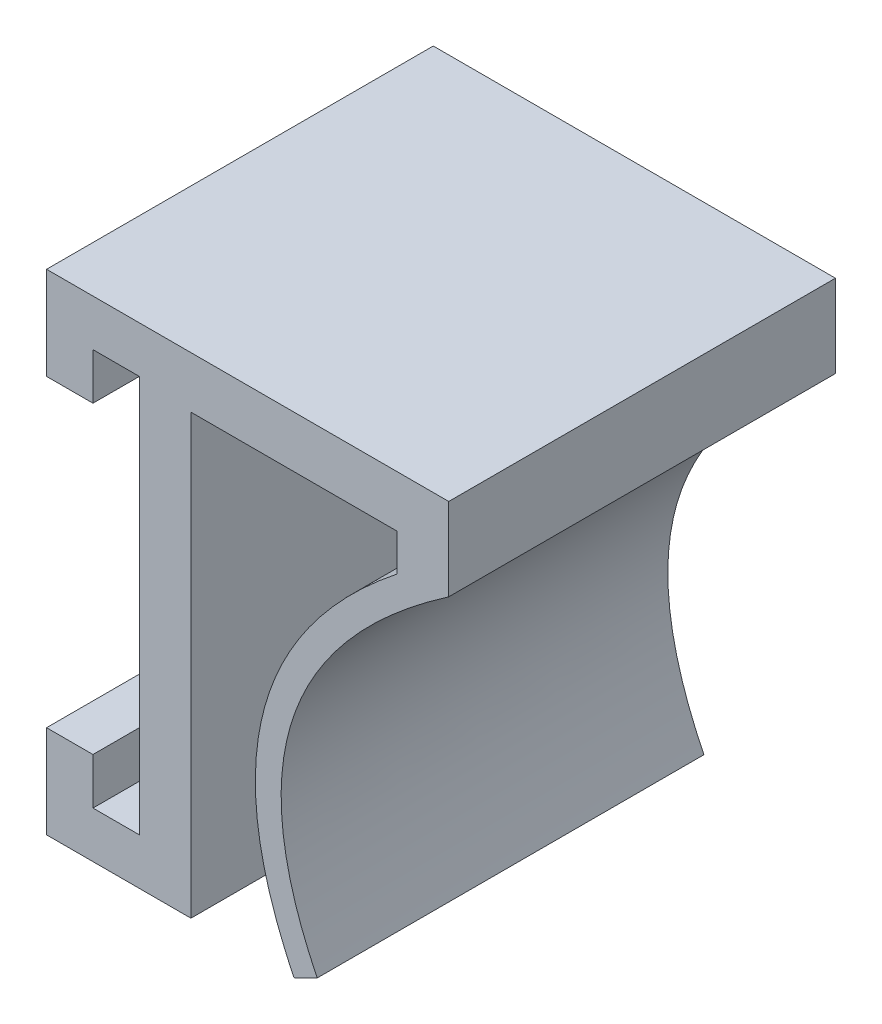
ISO-10303-21;
HEADER;
FILE_DESCRIPTION(('STEP AP214'),'2;1');
FILE_NAME('part.step','',(''),(''),'','','');
FILE_SCHEMA(('AUTOMOTIVE_DESIGN { 1 0 10303 214 1 1 1 1 }'));
ENDSEC;
DATA;
#1=APPLICATION_CONTEXT('core data for automotive mechanical design processes');
#2=APPLICATION_PROTOCOL_DEFINITION('international standard','automotive_design',2000,#1);
#3=PRODUCT_CONTEXT('',#1,'mechanical');
#4=PRODUCT('Part','Part','',(#3));
#5=PRODUCT_RELATED_PRODUCT_CATEGORY('part','',(#4));
#6=PRODUCT_DEFINITION_FORMATION('','',#4);
#7=PRODUCT_DEFINITION_CONTEXT('part definition',#1,'design');
#8=PRODUCT_DEFINITION('design','',#6,#7);
#9=PRODUCT_DEFINITION_SHAPE('','',#8);
#10=(LENGTH_UNIT() NAMED_UNIT(*) SI_UNIT(.MILLI.,.METRE.));
#11=(NAMED_UNIT(*) PLANE_ANGLE_UNIT() SI_UNIT($,.RADIAN.));
#12=(NAMED_UNIT(*) SI_UNIT($,.STERADIAN.) SOLID_ANGLE_UNIT());
#13=UNCERTAINTY_MEASURE_WITH_UNIT(LENGTH_MEASURE(1.E-05),#10,'distance_accuracy_value','');
#14=(GEOMETRIC_REPRESENTATION_CONTEXT(3) GLOBAL_UNCERTAINTY_ASSIGNED_CONTEXT((#13)) GLOBAL_UNIT_ASSIGNED_CONTEXT((#10,
#11,#12)) REPRESENTATION_CONTEXT('',''));
#15=CARTESIAN_POINT('',(0.,0.,0.));
#16=DIRECTION('',(0.,0.,1.));
#17=DIRECTION('',(1.,0.,0.));
#18=AXIS2_PLACEMENT_3D('',#15,#16,#17);
#19=CARTESIAN_POINT('',(-4.6,7.7,0.));
#20=DIRECTION('',(0.,1.,0.));
#21=DIRECTION('',(0.,0.,1.));
#22=AXIS2_PLACEMENT_3D('',#19,#20,#21);
#23=PLANE('',#22);
#24=DIRECTION('',(0.,0.,1.));
#25=VECTOR('',#24,1.);
#26=CARTESIAN_POINT('',(-2.8,7.7,0.));
#27=LINE('',#26,#25);
#28=CARTESIAN_POINT('',(-2.8,7.7,0.));
#29=VERTEX_POINT('',#28);
#30=CARTESIAN_POINT('',(-2.8,7.7,15.));
#31=VERTEX_POINT('',#30);
#32=EDGE_CURVE('E193',#29,#31,#27,.T.);
#33=ORIENTED_EDGE('',*,*,#32,.F.);
#34=DIRECTION('',(1.,0.,0.));
#35=VECTOR('',#34,1.);
#36=CARTESIAN_POINT('',(-4.6,7.7,0.));
#37=LINE('',#36,#35);
#38=CARTESIAN_POINT('',(-1.,7.7,0.));
#39=VERTEX_POINT('',#38);
#40=EDGE_CURVE('E41',#29,#39,#37,.T.);
#41=ORIENTED_EDGE('',*,*,#40,.T.);
#42=DIRECTION('',(0.,0.,1.));
#43=VECTOR('',#42,1.);
#44=CARTESIAN_POINT('',(-1.,7.7,0.));
#45=LINE('',#44,#43);
#46=CARTESIAN_POINT('',(-1.,7.7,15.));
#47=VERTEX_POINT('',#46);
#48=EDGE_CURVE('E178',#39,#47,#45,.T.);
#49=ORIENTED_EDGE('',*,*,#48,.T.);
#50=DIRECTION('',(1.,0.,0.));
#51=VECTOR('',#50,1.);
#52=CARTESIAN_POINT('',(-4.6,7.7,15.));
#53=LINE('',#52,#51);
#54=EDGE_CURVE('E234',#31,#47,#53,.T.);
#55=ORIENTED_EDGE('',*,*,#54,.F.);
#56=EDGE_LOOP('',(#33,#41,#49,#55));
#57=FACE_BOUND('',#56,.T.);
#58=ADVANCED_FACE('F37',(#57),#23,.F.);
#59=CARTESIAN_POINT('',(-4.6,-7.7,15.));
#60=DIRECTION('',(0.,-1.,0.));
#61=DIRECTION('',(0.,0.,-1.));
#62=AXIS2_PLACEMENT_3D('',#59,#60,#61);
#63=PLANE('',#62);
#64=DIRECTION('',(0.,0.,-1.));
#65=VECTOR('',#64,1.);
#66=CARTESIAN_POINT('',(-2.8,-7.7,15.));
#67=LINE('',#66,#65);
#68=CARTESIAN_POINT('',(-2.8,-7.7,15.));
#69=VERTEX_POINT('',#68);
#70=CARTESIAN_POINT('',(-2.8,-7.7,0.));
#71=VERTEX_POINT('',#70);
#72=EDGE_CURVE('E203',#69,#71,#67,.T.);
#73=ORIENTED_EDGE('',*,*,#72,.F.);
#74=DIRECTION('',(1.,0.,0.));
#75=VECTOR('',#74,1.);
#76=CARTESIAN_POINT('',(-4.6,-7.7,15.));
#77=LINE('',#76,#75);
#78=CARTESIAN_POINT('',(-1.,-7.7,15.));
#79=VERTEX_POINT('',#78);
#80=EDGE_CURVE('E230',#69,#79,#77,.T.);
#81=ORIENTED_EDGE('',*,*,#80,.T.);
#82=DIRECTION('',(0.,0.,-1.));
#83=VECTOR('',#82,1.);
#84=CARTESIAN_POINT('',(-1.,-7.7,15.));
#85=LINE('',#84,#83);
#86=CARTESIAN_POINT('',(-1.,-7.7,0.));
#87=VERTEX_POINT('',#86);
#88=EDGE_CURVE('E219',#79,#87,#85,.T.);
#89=ORIENTED_EDGE('',*,*,#88,.T.);
#90=DIRECTION('',(1.,0.,0.));
#91=VECTOR('',#90,1.);
#92=CARTESIAN_POINT('',(-4.6,-7.7,0.));
#93=LINE('',#92,#91);
#94=EDGE_CURVE('E55',#71,#87,#93,.T.);
#95=ORIENTED_EDGE('',*,*,#94,.F.);
#96=EDGE_LOOP('',(#73,#81,#89,#95));
#97=FACE_BOUND('',#96,.T.);
#98=ADVANCED_FACE('F359',(#97),#63,.F.);
#99=CARTESIAN_POINT('',(-1.,0.,15.));
#100=DIRECTION('',(-1.,0.,0.));
#101=DIRECTION('',(0.,0.,1.));
#102=AXIS2_PLACEMENT_3D('',#99,#100,#101);
#103=PLANE('',#102);
#104=DIRECTION('',(0.,1.,0.));
#105=VECTOR('',#104,1.);
#106=CARTESIAN_POINT('',(-1.,0.,0.));
#107=LINE('',#106,#105);
#108=EDGE_CURVE('E251',#87,#39,#107,.T.);
#109=ORIENTED_EDGE('',*,*,#108,.F.);
#110=ORIENTED_EDGE('',*,*,#88,.F.);
#111=DIRECTION('',(0.,1.,0.));
#112=VECTOR('',#111,1.);
#113=CARTESIAN_POINT('',(-1.,0.,15.));
#114=LINE('',#113,#112);
#115=EDGE_CURVE('E246',#79,#47,#114,.T.);
#116=ORIENTED_EDGE('',*,*,#115,.T.);
#117=ORIENTED_EDGE('',*,*,#48,.F.);
#118=EDGE_LOOP('',(#109,#110,#116,#117));
#119=FACE_BOUND('',#118,.T.);
#120=ADVANCED_FACE('F356',(#119),#103,.T.);
#121=CARTESIAN_POINT('',(9.00000000000001,0.,15.));
#122=DIRECTION('',(1.,0.,0.));
#123=DIRECTION('',(0.,1.,0.));
#124=AXIS2_PLACEMENT_3D('',#121,#122,#123);
#125=PLANE('',#124);
#126=DIRECTION('',(0.,-1.,0.));
#127=VECTOR('',#126,1.);
#128=CARTESIAN_POINT('',(9.00000000000001,0.,0.));
#129=LINE('',#128,#127);
#130=CARTESIAN_POINT('',(9.,7.5,0.));
#131=VERTEX_POINT('',#130);
#132=CARTESIAN_POINT('',(9.00000000000002,6.06380107189524,0.));
#133=VERTEX_POINT('',#132);
#134=EDGE_CURVE('E263',#131,#133,#129,.T.);
#135=ORIENTED_EDGE('',*,*,#134,.T.);
#136=DIRECTION('',(0.,0.,-1.));
#137=VECTOR('',#136,1.);
#138=CARTESIAN_POINT('',(9.00000000000002,6.06380107189524,15.));
#139=LINE('',#138,#137);
#140=CARTESIAN_POINT('',(9.00000000000002,6.06380107189524,15.));
#141=VERTEX_POINT('',#140);
#142=EDGE_CURVE('E11',#141,#133,#139,.T.);
#143=ORIENTED_EDGE('',*,*,#142,.F.);
#144=DIRECTION('',(0.,-1.,0.));
#145=VECTOR('',#144,1.);
#146=CARTESIAN_POINT('',(9.00000000000001,0.,15.));
#147=LINE('',#146,#145);
#148=CARTESIAN_POINT('',(9.,7.5,15.));
#149=VERTEX_POINT('',#148);
#150=EDGE_CURVE('E237',#149,#141,#147,.T.);
#151=ORIENTED_EDGE('',*,*,#150,.F.);
#152=DIRECTION('',(0.,0.,-1.));
#153=VECTOR('',#152,1.);
#154=CARTESIAN_POINT('',(9.,7.5,15.));
#155=LINE('',#154,#153);
#156=EDGE_CURVE('E262',#149,#131,#155,.T.);
#157=ORIENTED_EDGE('',*,*,#156,.T.);
#158=EDGE_LOOP('',(#135,#143,#151,#157));
#159=FACE_BOUND('',#158,.T.);
#160=ADVANCED_FACE('F39',(#159),#125,.F.);
#161=CARTESIAN_POINT('',(11.,7.5,15.));
#162=CARTESIAN_POINT('',(0.143474786083557,0.403042209398093,15.));
#163=CARTESIAN_POINT('',(5.,-9.5,15.));
#164=B_SPLINE_CURVE_WITH_KNOTS('',2,(#161,#162,#163),.UNSPECIFIED.,.F.,.F.,(3,3),(0.,1.),.UNSPECIFIED.);
#165=DIRECTION('',(0.,0.,-1.));
#166=VECTOR('',#165,1.);
#167=SURFACE_OF_LINEAR_EXTRUSION('',#164,#166);
#168=CARTESIAN_POINT('',(11.,7.5,0.));
#169=CARTESIAN_POINT('',(0.143474786083557,0.403042209398093,0.));
#170=CARTESIAN_POINT('',(5.,-9.5,0.));
#171=B_SPLINE_CURVE_WITH_KNOTS('',2,(#168,#169,#170),.UNSPECIFIED.,.F.,.F.,(3,3),(0.,1.),.UNSPECIFIED.);
#172=CARTESIAN_POINT('',(5.,-9.5,0.));
#173=VERTEX_POINT('',#172);
#174=EDGE_CURVE('E266',#133,#173,#171,.T.);
#175=ORIENTED_EDGE('',*,*,#174,.T.);
#176=DIRECTION('',(0.,0.,-1.));
#177=VECTOR('',#176,1.);
#178=CARTESIAN_POINT('',(5.,-9.5,15.));
#179=LINE('',#178,#177);
#180=CARTESIAN_POINT('',(5.,-9.5,15.));
#181=VERTEX_POINT('',#180);
#182=EDGE_CURVE('E47',#181,#173,#179,.T.);
#183=ORIENTED_EDGE('',*,*,#182,.F.);
#184=EDGE_CURVE('E332',#141,#181,#164,.T.);
#185=ORIENTED_EDGE('',*,*,#184,.F.);
#186=ORIENTED_EDGE('',*,*,#142,.T.);
#187=EDGE_LOOP('',(#175,#183,#185,#186));
#188=FACE_BOUND('',#187,.T.);
#189=ADVANCED_FACE('F318',(#188),#167,.F.);
#190=CARTESIAN_POINT('',(4.72500618414528,-9.63485900313563,15.));
#191=DIRECTION('',(0.440310188345007,-0.897845720622192,0.));
#192=DIRECTION('',(0.897845720622193,0.440310188345007,0.));
#193=AXIS2_PLACEMENT_3D('',#190,#191,#192);
#194=PLANE('',#193);
#195=DIRECTION('',(-0.897845720622193,-0.440310188345007,0.));
#196=VECTOR('',#195,1.);
#197=CARTESIAN_POINT('',(4.72500618414528,-9.63485900313563,0.));
#198=LINE('',#197,#196);
#199=CARTESIAN_POINT('',(5.89784572062219,-9.05968981165499,0.));
#200=VERTEX_POINT('',#199);
#201=EDGE_CURVE('E271',#200,#173,#198,.T.);
#202=ORIENTED_EDGE('',*,*,#201,.F.);
#203=DIRECTION('',(0.,0.,-1.));
#204=VECTOR('',#203,1.);
#205=CARTESIAN_POINT('',(5.89784572062219,-9.05968981165499,15.));
#206=LINE('',#205,#204);
#207=CARTESIAN_POINT('',(5.89784572062219,-9.05968981165499,15.));
#208=VERTEX_POINT('',#207);
#209=EDGE_CURVE('E309',#208,#200,#206,.T.);
#210=ORIENTED_EDGE('',*,*,#209,.F.);
#211=DIRECTION('',(-0.897845720622193,-0.440310188345007,0.));
#212=VECTOR('',#211,1.);
#213=CARTESIAN_POINT('',(4.72500618414528,-9.63485900313563,15.));
#214=LINE('',#213,#212);
#215=EDGE_CURVE('E316',#208,#181,#214,.T.);
#216=ORIENTED_EDGE('',*,*,#215,.T.);
#217=ORIENTED_EDGE('',*,*,#182,.T.);
#218=EDGE_LOOP('',(#202,#210,#216,#217));
#219=FACE_BOUND('',#218,.T.);
#220=ADVANCED_FACE('F314',(#219),#194,.T.);
#221=CARTESIAN_POINT('',(11.5470604344014,6.66313817495737,15.));
#222=CARTESIAN_POINT('',(11.1227751702756,6.38577545488294,15.));
#223=CARTESIAN_POINT('',(10.2701754162105,5.79545603749895,15.));
#224=CARTESIAN_POINT('',(8.78130683710781,4.62611565499444,15.));
#225=CARTESIAN_POINT('',(7.21781689140354,3.11882700941996,15.));
#226=CARTESIAN_POINT('',(5.84244774640844,1.26956398370126,15.));
#227=CARTESIAN_POINT('',(4.93949451068362,-0.62198273362906,15.));
#228=CARTESIAN_POINT('',(4.48743622100348,-2.56912245970935,15.));
#229=CARTESIAN_POINT('',(4.47319251706102,-4.6027365782481,15.));
#230=CARTESIAN_POINT('',(4.83887317710128,-6.40107531519846,15.));
#231=CARTESIAN_POINT('',(5.36072254535897,-7.89234167440535,15.));
#232=CARTESIAN_POINT('',(5.71204382820357,-8.68082613964558,15.));
#233=CARTESIAN_POINT('',(5.89784572062217,-9.05968981165496,15.));
#234=B_SPLINE_CURVE_WITH_KNOTS('',3,(#221,#222,#223,#224,#225,#226,#227,#228,#229,#230,#231,
#232,#233),.UNSPECIFIED.,.F.,.F.,(4,1,1,1,1,1,1,1,1,1,4),(0.,0.0625,0.125,0.25,0.375,0.5,0.625,
0.75,0.875,0.9375,1.),.UNSPECIFIED.);
#235=DIRECTION('',(0.,0.,-1.));
#236=VECTOR('',#235,1.);
#237=SURFACE_OF_LINEAR_EXTRUSION('',#234,#236);
#238=CARTESIAN_POINT('',(11.5470604344014,6.66313817495737,0.));
#239=CARTESIAN_POINT('',(11.1227751702756,6.38577545488294,0.));
#240=CARTESIAN_POINT('',(10.2701754162105,5.79545603749895,0.));
#241=CARTESIAN_POINT('',(8.78130683710781,4.62611565499444,0.));
#242=CARTESIAN_POINT('',(7.21781689140354,3.11882700941996,0.));
#243=CARTESIAN_POINT('',(5.84244774640844,1.26956398370126,0.));
#244=CARTESIAN_POINT('',(4.93949451068362,-0.62198273362906,0.));
#245=CARTESIAN_POINT('',(4.48743622100348,-2.56912245970935,0.));
#246=CARTESIAN_POINT('',(4.47319251706102,-4.6027365782481,0.));
#247=CARTESIAN_POINT('',(4.83887317710128,-6.40107531519846,0.));
#248=CARTESIAN_POINT('',(5.36072254535897,-7.89234167440535,0.));
#249=CARTESIAN_POINT('',(5.71204382820357,-8.68082613964558,0.));
#250=CARTESIAN_POINT('',(5.89784572062217,-9.05968981165496,0.));
#251=B_SPLINE_CURVE_WITH_KNOTS('',3,(#238,#239,#240,#241,#242,#243,#244,#245,#246,#247,#248,
#249,#250),.UNSPECIFIED.,.F.,.F.,(4,1,1,1,1,1,1,1,1,1,4),(0.,0.0625,0.125,0.25,0.375,0.5,0.625,
0.75,0.875,0.9375,1.),.UNSPECIFIED.);
#252=CARTESIAN_POINT('',(11.,6.29635969257211,0.));
#253=VERTEX_POINT('',#252);
#254=EDGE_CURVE('E277',#253,#200,#251,.T.);
#255=ORIENTED_EDGE('',*,*,#254,.F.);
#256=DIRECTION('',(0.,0.,-1.));
#257=VECTOR('',#256,1.);
#258=CARTESIAN_POINT('',(11.,6.29635969257211,15.));
#259=LINE('',#258,#257);
#260=CARTESIAN_POINT('',(11.,6.29635969257211,15.));
#261=VERTEX_POINT('',#260);
#262=EDGE_CURVE('E307',#261,#253,#259,.T.);
#263=ORIENTED_EDGE('',*,*,#262,.F.);
#264=EDGE_CURVE('E326',#261,#208,#234,.T.);
#265=ORIENTED_EDGE('',*,*,#264,.T.);
#266=ORIENTED_EDGE('',*,*,#209,.T.);
#267=EDGE_LOOP('',(#255,#263,#265,#266));
#268=FACE_BOUND('',#267,.T.);
#269=ADVANCED_FACE('F323',(#268),#237,.T.);
#270=CARTESIAN_POINT('',(11.,0.,15.));
#271=DIRECTION('',(1.,0.,0.));
#272=DIRECTION('',(0.,1.,0.));
#273=AXIS2_PLACEMENT_3D('',#270,#271,#272);
#274=PLANE('',#273);
#275=DIRECTION('',(0.,-1.,0.));
#276=VECTOR('',#275,1.);
#277=CARTESIAN_POINT('',(11.,0.,0.));
#278=LINE('',#277,#276);
#279=CARTESIAN_POINT('',(11.,9.5,0.));
#280=VERTEX_POINT('',#279);
#281=EDGE_CURVE('E282',#280,#253,#278,.T.);
#282=ORIENTED_EDGE('',*,*,#281,.F.);
#283=DIRECTION('',(0.,0.,-1.));
#284=VECTOR('',#283,1.);
#285=CARTESIAN_POINT('',(11.,9.5,15.));
#286=LINE('',#285,#284);
#287=CARTESIAN_POINT('',(11.,9.5,15.));
#288=VERTEX_POINT('',#287);
#289=EDGE_CURVE('E305',#288,#280,#286,.T.);
#290=ORIENTED_EDGE('',*,*,#289,.F.);
#291=DIRECTION('',(0.,-1.,0.));
#292=VECTOR('',#291,1.);
#293=CARTESIAN_POINT('',(11.,0.,15.));
#294=LINE('',#293,#292);
#295=EDGE_CURVE('E334',#288,#261,#294,.T.);
#296=ORIENTED_EDGE('',*,*,#295,.T.);
#297=ORIENTED_EDGE('',*,*,#262,.T.);
#298=EDGE_LOOP('',(#282,#290,#296,#297));
#299=FACE_BOUND('',#298,.T.);
#300=ADVANCED_FACE('F349',(#299),#274,.T.);
#301=CARTESIAN_POINT('',(0.,9.5,15.));
#302=DIRECTION('',(0.,1.,0.));
#303=DIRECTION('',(0.,0.,1.));
#304=AXIS2_PLACEMENT_3D('',#301,#302,#303);
#305=PLANE('',#304);
#306=DIRECTION('',(1.,0.,0.));
#307=VECTOR('',#306,1.);
#308=CARTESIAN_POINT('',(0.,9.5,0.));
#309=LINE('',#308,#307);
#310=CARTESIAN_POINT('',(-4.6,9.5,0.));
#311=VERTEX_POINT('',#310);
#312=EDGE_CURVE('E288',#311,#280,#309,.T.);
#313=ORIENTED_EDGE('',*,*,#312,.F.);
#314=DIRECTION('',(0.,0.,-1.));
#315=VECTOR('',#314,1.);
#316=CARTESIAN_POINT('',(-4.6,9.5,0.));
#317=LINE('',#316,#315);
#318=CARTESIAN_POINT('',(-4.6,9.5,15.));
#319=VERTEX_POINT('',#318);
#320=EDGE_CURVE('E175',#319,#311,#317,.T.);
#321=ORIENTED_EDGE('',*,*,#320,.F.);
#322=DIRECTION('',(1.,0.,0.));
#323=VECTOR('',#322,1.);
#324=CARTESIAN_POINT('',(0.,9.5,15.));
#325=LINE('',#324,#323);
#326=EDGE_CURVE('E250',#319,#288,#325,.T.);
#327=ORIENTED_EDGE('',*,*,#326,.T.);
#328=ORIENTED_EDGE('',*,*,#289,.T.);
#329=EDGE_LOOP('',(#313,#321,#327,#328));
#330=FACE_BOUND('',#329,.T.);
#331=ADVANCED_FACE('F383',(#330),#305,.T.);
#332=CARTESIAN_POINT('',(0.,-9.5,15.));
#333=DIRECTION('',(0.,1.,0.));
#334=DIRECTION('',(0.,0.,1.));
#335=AXIS2_PLACEMENT_3D('',#332,#333,#334);
#336=PLANE('',#335);
#337=DIRECTION('',(1.,0.,0.));
#338=VECTOR('',#337,1.);
#339=CARTESIAN_POINT('',(0.,-9.5,0.));
#340=LINE('',#339,#338);
#341=CARTESIAN_POINT('',(-4.6,-9.5,0.));
#342=VERTEX_POINT('',#341);
#343=CARTESIAN_POINT('',(1.,-9.5,0.));
#344=VERTEX_POINT('',#343);
#345=EDGE_CURVE('E291',#342,#344,#340,.T.);
#346=ORIENTED_EDGE('',*,*,#345,.T.);
#347=DIRECTION('',(0.,0.,-1.));
#348=VECTOR('',#347,1.);
#349=CARTESIAN_POINT('',(1.,-9.5,15.));
#350=LINE('',#349,#348);
#351=CARTESIAN_POINT('',(1.,-9.5,15.));
#352=VERTEX_POINT('',#351);
#353=EDGE_CURVE('E302',#352,#344,#350,.T.);
#354=ORIENTED_EDGE('',*,*,#353,.F.);
#355=DIRECTION('',(1.,0.,0.));
#356=VECTOR('',#355,1.);
#357=CARTESIAN_POINT('',(0.,-9.5,15.));
#358=LINE('',#357,#356);
#359=CARTESIAN_POINT('',(-4.6,-9.5,15.));
#360=VERTEX_POINT('',#359);
#361=EDGE_CURVE('E249',#360,#352,#358,.T.);
#362=ORIENTED_EDGE('',*,*,#361,.F.);
#363=DIRECTION('',(0.,0.,1.));
#364=VECTOR('',#363,1.);
#365=CARTESIAN_POINT('',(-4.6,-9.5,15.));
#366=LINE('',#365,#364);
#367=EDGE_CURVE('E225',#342,#360,#366,.T.);
#368=ORIENTED_EDGE('',*,*,#367,.F.);
#369=EDGE_LOOP('',(#346,#354,#362,#368));
#370=FACE_BOUND('',#369,.T.);
#371=ADVANCED_FACE('F379',(#370),#336,.F.);
#372=CARTESIAN_POINT('',(1.,0.,15.));
#373=DIRECTION('',(-1.,0.,0.));
#374=DIRECTION('',(0.,-1.,0.));
#375=AXIS2_PLACEMENT_3D('',#372,#373,#374);
#376=PLANE('',#375);
#377=DIRECTION('',(0.,1.,0.));
#378=VECTOR('',#377,1.);
#379=CARTESIAN_POINT('',(1.,0.,0.));
#380=LINE('',#379,#378);
#381=CARTESIAN_POINT('',(1.,7.5,0.));
#382=VERTEX_POINT('',#381);
#383=EDGE_CURVE('E293',#344,#382,#380,.T.);
#384=ORIENTED_EDGE('',*,*,#383,.T.);
#385=DIRECTION('',(0.,0.,-1.));
#386=VECTOR('',#385,1.);
#387=CARTESIAN_POINT('',(1.,7.5,15.));
#388=LINE('',#387,#386);
#389=CARTESIAN_POINT('',(1.,7.5,15.));
#390=VERTEX_POINT('',#389);
#391=EDGE_CURVE('E299',#390,#382,#388,.T.);
#392=ORIENTED_EDGE('',*,*,#391,.F.);
#393=DIRECTION('',(0.,1.,0.));
#394=VECTOR('',#393,1.);
#395=CARTESIAN_POINT('',(1.,0.,15.));
#396=LINE('',#395,#394);
#397=EDGE_CURVE('E258',#352,#390,#396,.T.);
#398=ORIENTED_EDGE('',*,*,#397,.F.);
#399=ORIENTED_EDGE('',*,*,#353,.T.);
#400=EDGE_LOOP('',(#384,#392,#398,#399));
#401=FACE_BOUND('',#400,.T.);
#402=ADVANCED_FACE('F375',(#401),#376,.F.);
#403=CARTESIAN_POINT('',(0.,7.5,15.));
#404=DIRECTION('',(0.,1.,0.));
#405=DIRECTION('',(0.,0.,1.));
#406=AXIS2_PLACEMENT_3D('',#403,#404,#405);
#407=PLANE('',#406);
#408=DIRECTION('',(1.,0.,0.));
#409=VECTOR('',#408,1.);
#410=CARTESIAN_POINT('',(0.,7.5,0.));
#411=LINE('',#410,#409);
#412=EDGE_CURVE('E295',#382,#131,#411,.T.);
#413=ORIENTED_EDGE('',*,*,#412,.T.);
#414=ORIENTED_EDGE('',*,*,#156,.F.);
#415=DIRECTION('',(1.,0.,0.));
#416=VECTOR('',#415,1.);
#417=CARTESIAN_POINT('',(0.,7.5,15.));
#418=LINE('',#417,#416);
#419=EDGE_CURVE('E260',#390,#149,#418,.T.);
#420=ORIENTED_EDGE('',*,*,#419,.F.);
#421=ORIENTED_EDGE('',*,*,#391,.T.);
#422=EDGE_LOOP('',(#413,#414,#420,#421));
#423=FACE_BOUND('',#422,.T.);
#424=ADVANCED_FACE('F370',(#423),#407,.F.);
#425=CARTESIAN_POINT('',(0.,0.,15.));
#426=DIRECTION('',(0.,0.,1.));
#427=DIRECTION('',(1.,0.,0.));
#428=AXIS2_PLACEMENT_3D('',#425,#426,#427);
#429=PLANE('',#428);
#430=ORIENTED_EDGE('',*,*,#150,.T.);
#431=ORIENTED_EDGE('',*,*,#184,.T.);
#432=ORIENTED_EDGE('',*,*,#215,.F.);
#433=ORIENTED_EDGE('',*,*,#264,.F.);
#434=ORIENTED_EDGE('',*,*,#295,.F.);
#435=ORIENTED_EDGE('',*,*,#326,.F.);
#436=DIRECTION('',(0.,1.,0.));
#437=VECTOR('',#436,1.);
#438=CARTESIAN_POINT('',(-4.6,9.5,15.));
#439=LINE('',#438,#437);
#440=CARTESIAN_POINT('',(-4.6,5.9,15.));
#441=VERTEX_POINT('',#440);
#442=EDGE_CURVE('E177',#441,#319,#439,.T.);
#443=ORIENTED_EDGE('',*,*,#442,.F.);
#444=DIRECTION('',(-1.,0.,0.));
#445=VECTOR('',#444,1.);
#446=CARTESIAN_POINT('',(-4.6,5.9,15.));
#447=LINE('',#446,#445);
#448=CARTESIAN_POINT('',(-2.8,5.9,15.));
#449=VERTEX_POINT('',#448);
#450=EDGE_CURVE('E192',#449,#441,#447,.T.);
#451=ORIENTED_EDGE('',*,*,#450,.F.);
#452=DIRECTION('',(0.,1.,0.));
#453=VECTOR('',#452,1.);
#454=CARTESIAN_POINT('',(-2.8,5.9,15.));
#455=LINE('',#454,#453);
#456=EDGE_CURVE('E198',#449,#31,#455,.T.);
#457=ORIENTED_EDGE('',*,*,#456,.T.);
#458=ORIENTED_EDGE('',*,*,#54,.T.);
#459=ORIENTED_EDGE('',*,*,#115,.F.);
#460=ORIENTED_EDGE('',*,*,#80,.F.);
#461=DIRECTION('',(0.,-1.,0.));
#462=VECTOR('',#461,1.);
#463=CARTESIAN_POINT('',(-2.8,-5.9,15.));
#464=LINE('',#463,#462);
#465=CARTESIAN_POINT('',(-2.8,-5.9,15.));
#466=VERTEX_POINT('',#465);
#467=EDGE_CURVE('E217',#466,#69,#464,.T.);
#468=ORIENTED_EDGE('',*,*,#467,.F.);
#469=DIRECTION('',(1.,0.,0.));
#470=VECTOR('',#469,1.);
#471=CARTESIAN_POINT('',(-4.6,-5.9,15.));
#472=LINE('',#471,#470);
#473=CARTESIAN_POINT('',(-4.6,-5.9,15.));
#474=VERTEX_POINT('',#473);
#475=EDGE_CURVE('E207',#474,#466,#472,.T.);
#476=ORIENTED_EDGE('',*,*,#475,.F.);
#477=DIRECTION('',(0.,1.,0.));
#478=VECTOR('',#477,1.);
#479=CARTESIAN_POINT('',(-4.6,-9.5,15.));
#480=LINE('',#479,#478);
#481=EDGE_CURVE('E220',#360,#474,#480,.T.);
#482=ORIENTED_EDGE('',*,*,#481,.F.);
#483=ORIENTED_EDGE('',*,*,#361,.T.);
#484=ORIENTED_EDGE('',*,*,#397,.T.);
#485=ORIENTED_EDGE('',*,*,#419,.T.);
#486=EDGE_LOOP('',(#430,#431,#432,#433,#434,#435,#443,#451,#457,#458,#459,#460,#468,#476,#482,
#483,#484,#485));
#487=FACE_BOUND('',#486,.T.);
#488=ADVANCED_FACE('F329',(#487),#429,.T.);
#489=CARTESIAN_POINT('',(0.,0.,0.));
#490=DIRECTION('',(0.,0.,1.));
#491=DIRECTION('',(1.,0.,0.));
#492=AXIS2_PLACEMENT_3D('',#489,#490,#491);
#493=PLANE('',#492);
#494=ORIENTED_EDGE('',*,*,#134,.F.);
#495=ORIENTED_EDGE('',*,*,#412,.F.);
#496=ORIENTED_EDGE('',*,*,#383,.F.);
#497=ORIENTED_EDGE('',*,*,#345,.F.);
#498=DIRECTION('',(0.,-1.,0.));
#499=VECTOR('',#498,1.);
#500=CARTESIAN_POINT('',(-4.6,-9.5,0.));
#501=LINE('',#500,#499);
#502=CARTESIAN_POINT('',(-4.6,-5.9,0.));
#503=VERTEX_POINT('',#502);
#504=EDGE_CURVE('E222',#503,#342,#501,.T.);
#505=ORIENTED_EDGE('',*,*,#504,.F.);
#506=DIRECTION('',(-1.,0.,0.));
#507=VECTOR('',#506,1.);
#508=CARTESIAN_POINT('',(-4.6,-5.9,0.));
#509=LINE('',#508,#507);
#510=CARTESIAN_POINT('',(-2.8,-5.9,0.));
#511=VERTEX_POINT('',#510);
#512=EDGE_CURVE('E211',#511,#503,#509,.T.);
#513=ORIENTED_EDGE('',*,*,#512,.F.);
#514=DIRECTION('',(0.,-1.,0.));
#515=VECTOR('',#514,1.);
#516=CARTESIAN_POINT('',(-2.8,-5.9,0.));
#517=LINE('',#516,#515);
#518=EDGE_CURVE('E214',#511,#71,#517,.T.);
#519=ORIENTED_EDGE('',*,*,#518,.T.);
#520=ORIENTED_EDGE('',*,*,#94,.T.);
#521=ORIENTED_EDGE('',*,*,#108,.T.);
#522=ORIENTED_EDGE('',*,*,#40,.F.);
#523=DIRECTION('',(0.,1.,0.));
#524=VECTOR('',#523,1.);
#525=CARTESIAN_POINT('',(-2.8,5.9,0.));
#526=LINE('',#525,#524);
#527=CARTESIAN_POINT('',(-2.8,5.9,0.));
#528=VERTEX_POINT('',#527);
#529=EDGE_CURVE('E184',#528,#29,#526,.T.);
#530=ORIENTED_EDGE('',*,*,#529,.F.);
#531=DIRECTION('',(1.,0.,0.));
#532=VECTOR('',#531,1.);
#533=CARTESIAN_POINT('',(-4.6,5.9,0.));
#534=LINE('',#533,#532);
#535=CARTESIAN_POINT('',(-4.6,5.9,0.));
#536=VERTEX_POINT('',#535);
#537=EDGE_CURVE('E181',#536,#528,#534,.T.);
#538=ORIENTED_EDGE('',*,*,#537,.F.);
#539=DIRECTION('',(0.,-1.,0.));
#540=VECTOR('',#539,1.);
#541=CARTESIAN_POINT('',(-4.6,9.5,0.));
#542=LINE('',#541,#540);
#543=EDGE_CURVE('E168',#311,#536,#542,.T.);
#544=ORIENTED_EDGE('',*,*,#543,.F.);
#545=ORIENTED_EDGE('',*,*,#312,.T.);
#546=ORIENTED_EDGE('',*,*,#281,.T.);
#547=ORIENTED_EDGE('',*,*,#254,.T.);
#548=ORIENTED_EDGE('',*,*,#201,.T.);
#549=ORIENTED_EDGE('',*,*,#174,.F.);
#550=EDGE_LOOP('',(#494,#495,#496,#497,#505,#513,#519,#520,#521,#522,#530,#538,#544,#545,#546,
#547,#548,#549));
#551=FACE_BOUND('',#550,.T.);
#552=ADVANCED_FACE('F183',(#551),#493,.F.);
#553=CARTESIAN_POINT('',(-4.6,0.,0.));
#554=DIRECTION('',(-1.,0.,0.));
#555=DIRECTION('',(0.,0.,1.));
#556=AXIS2_PLACEMENT_3D('',#553,#554,#555);
#557=PLANE('',#556);
#558=ORIENTED_EDGE('',*,*,#543,.T.);
#559=DIRECTION('',(0.,0.,-1.));
#560=VECTOR('',#559,1.);
#561=CARTESIAN_POINT('',(-4.6,5.9,0.));
#562=LINE('',#561,#560);
#563=EDGE_CURVE('E173',#441,#536,#562,.T.);
#564=ORIENTED_EDGE('',*,*,#563,.F.);
#565=ORIENTED_EDGE('',*,*,#442,.T.);
#566=ORIENTED_EDGE('',*,*,#320,.T.);
#567=EDGE_LOOP('',(#558,#564,#565,#566));
#568=FACE_BOUND('',#567,.T.);
#569=ADVANCED_FACE('F170',(#568),#557,.T.);
#570=CARTESIAN_POINT('',(-4.6,0.,0.));
#571=DIRECTION('',(-1.,0.,0.));
#572=DIRECTION('',(0.,0.,1.));
#573=AXIS2_PLACEMENT_3D('',#570,#571,#572);
#574=PLANE('',#573);
#575=ORIENTED_EDGE('',*,*,#481,.T.);
#576=DIRECTION('',(0.,0.,1.));
#577=VECTOR('',#576,1.);
#578=CARTESIAN_POINT('',(-4.6,-5.9,15.));
#579=LINE('',#578,#577);
#580=EDGE_CURVE('E204',#503,#474,#579,.T.);
#581=ORIENTED_EDGE('',*,*,#580,.F.);
#582=ORIENTED_EDGE('',*,*,#504,.T.);
#583=ORIENTED_EDGE('',*,*,#367,.T.);
#584=EDGE_LOOP('',(#575,#581,#582,#583));
#585=FACE_BOUND('',#584,.T.);
#586=ADVANCED_FACE('F414',(#585),#574,.T.);
#587=CARTESIAN_POINT('',(-2.8,-5.9,15.));
#588=DIRECTION('',(-1.,0.,0.));
#589=DIRECTION('',(0.,0.,1.));
#590=AXIS2_PLACEMENT_3D('',#587,#588,#589);
#591=PLANE('',#590);
#592=ORIENTED_EDGE('',*,*,#72,.T.);
#593=ORIENTED_EDGE('',*,*,#518,.F.);
#594=DIRECTION('',(0.,0.,-1.));
#595=VECTOR('',#594,1.);
#596=CARTESIAN_POINT('',(-2.8,-5.9,15.));
#597=LINE('',#596,#595);
#598=EDGE_CURVE('E209',#466,#511,#597,.T.);
#599=ORIENTED_EDGE('',*,*,#598,.F.);
#600=ORIENTED_EDGE('',*,*,#467,.T.);
#601=EDGE_LOOP('',(#592,#593,#599,#600));
#602=FACE_BOUND('',#601,.T.);
#603=ADVANCED_FACE('F408',(#602),#591,.F.);
#604=CARTESIAN_POINT('',(0.,-5.9,0.));
#605=DIRECTION('',(0.,-1.,0.));
#606=DIRECTION('',(0.,0.,-1.));
#607=AXIS2_PLACEMENT_3D('',#604,#605,#606);
#608=PLANE('',#607);
#609=ORIENTED_EDGE('',*,*,#580,.T.);
#610=ORIENTED_EDGE('',*,*,#475,.T.);
#611=ORIENTED_EDGE('',*,*,#598,.T.);
#612=ORIENTED_EDGE('',*,*,#512,.T.);
#613=EDGE_LOOP('',(#609,#610,#611,#612));
#614=FACE_BOUND('',#613,.T.);
#615=ADVANCED_FACE('F412',(#614),#608,.F.);
#616=CARTESIAN_POINT('',(-2.8,5.9,0.));
#617=DIRECTION('',(-1.,0.,0.));
#618=DIRECTION('',(0.,0.,1.));
#619=AXIS2_PLACEMENT_3D('',#616,#617,#618);
#620=PLANE('',#619);
#621=ORIENTED_EDGE('',*,*,#32,.T.);
#622=ORIENTED_EDGE('',*,*,#456,.F.);
#623=DIRECTION('',(0.,0.,1.));
#624=VECTOR('',#623,1.);
#625=CARTESIAN_POINT('',(-2.8,5.9,0.));
#626=LINE('',#625,#624);
#627=EDGE_CURVE('E187',#528,#449,#626,.T.);
#628=ORIENTED_EDGE('',*,*,#627,.F.);
#629=ORIENTED_EDGE('',*,*,#529,.T.);
#630=EDGE_LOOP('',(#621,#622,#628,#629));
#631=FACE_BOUND('',#630,.T.);
#632=ADVANCED_FACE('F435',(#631),#620,.F.);
#633=CARTESIAN_POINT('',(0.,5.9,0.));
#634=DIRECTION('',(0.,1.,0.));
#635=DIRECTION('',(0.,0.,1.));
#636=AXIS2_PLACEMENT_3D('',#633,#634,#635);
#637=PLANE('',#636);
#638=ORIENTED_EDGE('',*,*,#563,.T.);
#639=ORIENTED_EDGE('',*,*,#537,.T.);
#640=ORIENTED_EDGE('',*,*,#627,.T.);
#641=ORIENTED_EDGE('',*,*,#450,.T.);
#642=EDGE_LOOP('',(#638,#639,#640,#641));
#643=FACE_BOUND('',#642,.T.);
#644=ADVANCED_FACE('F190',(#643),#637,.F.);
#645=CLOSED_SHELL('',(#58,#98,#120,#160,#189,#220,#269,#300,#331,#371,#402,#424,#488,#552,#569,
#586,#603,#615,#632,#644));
#646=MANIFOLD_SOLID_BREP('B2',#645);
#647=ADVANCED_BREP_SHAPE_REPRESENTATION('',(#18,#646),#14);
#648=SHAPE_DEFINITION_REPRESENTATION(#9,#647);
ENDSEC;
END-ISO-10303-21;
